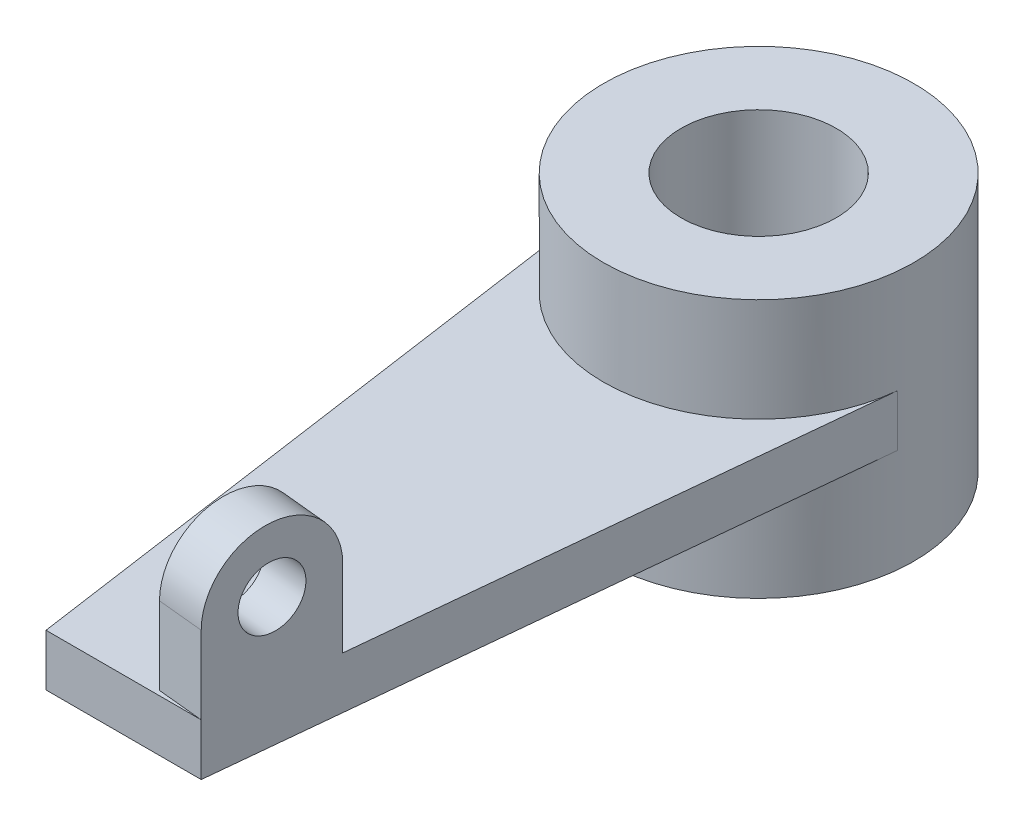
ISO-10303-21;
HEADER;
FILE_DESCRIPTION(('STEP AP214'),'2;1');
FILE_NAME('part.step','',(''),(''),'','','');
FILE_SCHEMA(('AUTOMOTIVE_DESIGN { 1 0 10303 214 1 1 1 1 }'));
ENDSEC;
DATA;
#1=APPLICATION_CONTEXT('core data for automotive mechanical design processes');
#2=APPLICATION_PROTOCOL_DEFINITION('international standard','automotive_design',2000,#1);
#3=PRODUCT_CONTEXT('',#1,'mechanical');
#4=PRODUCT('Part','Part','',(#3));
#5=PRODUCT_RELATED_PRODUCT_CATEGORY('part','',(#4));
#6=PRODUCT_DEFINITION_FORMATION('','',#4);
#7=PRODUCT_DEFINITION_CONTEXT('part definition',#1,'design');
#8=PRODUCT_DEFINITION('design','',#6,#7);
#9=PRODUCT_DEFINITION_SHAPE('','',#8);
#10=(LENGTH_UNIT() NAMED_UNIT(*) SI_UNIT(.MILLI.,.METRE.));
#11=(NAMED_UNIT(*) PLANE_ANGLE_UNIT() SI_UNIT($,.RADIAN.));
#12=(NAMED_UNIT(*) SI_UNIT($,.STERADIAN.) SOLID_ANGLE_UNIT());
#13=UNCERTAINTY_MEASURE_WITH_UNIT(LENGTH_MEASURE(1.E-05),#10,'distance_accuracy_value','');
#14=(GEOMETRIC_REPRESENTATION_CONTEXT(3) GLOBAL_UNCERTAINTY_ASSIGNED_CONTEXT((#13)) GLOBAL_UNIT_ASSIGNED_CONTEXT((#10,
#11,#12)) REPRESENTATION_CONTEXT('',''));
#15=CARTESIAN_POINT('',(0.,0.,0.));
#16=DIRECTION('',(0.,0.,1.));
#17=DIRECTION('',(1.,0.,0.));
#18=AXIS2_PLACEMENT_3D('',#15,#16,#17);
#19=CARTESIAN_POINT('',(0.,25.,0.));
#20=DIRECTION('',(0.,1.,0.));
#21=DIRECTION('',(0.,0.,1.));
#22=AXIS2_PLACEMENT_3D('',#19,#20,#21);
#23=PLANE('',#22);
#24=CARTESIAN_POINT('',(0.,25.,0.));
#25=DIRECTION('',(0.,1.,0.));
#26=DIRECTION('',(0.,0.,1.));
#27=AXIS2_PLACEMENT_3D('',#24,#25,#26);
#28=CIRCLE('',#27,30.);
#29=CARTESIAN_POINT('',(0.,25.,30.));
#30=VERTEX_POINT('',#29);
#31=EDGE_CURVE('E175',#30,#30,#28,.T.);
#32=ORIENTED_EDGE('',*,*,#31,.T.);
#33=EDGE_LOOP('',(#32));
#34=FACE_BOUND('',#33,.T.);
#35=CARTESIAN_POINT('',(0.,25.,0.));
#36=DIRECTION('',(0.,1.,0.));
#37=DIRECTION('',(0.,0.,1.));
#38=AXIS2_PLACEMENT_3D('',#35,#36,#37);
#39=CIRCLE('',#38,15.);
#40=CARTESIAN_POINT('',(0.,25.,15.));
#41=VERTEX_POINT('',#40);
#42=EDGE_CURVE('E169',#41,#41,#39,.T.);
#43=ORIENTED_EDGE('',*,*,#42,.F.);
#44=EDGE_LOOP('',(#43));
#45=FACE_BOUND('',#44,.T.);
#46=ADVANCED_FACE('F33',(#34,#45),#23,.T.);
#47=CARTESIAN_POINT('',(0.,-25.,0.));
#48=DIRECTION('',(0.,1.,0.));
#49=DIRECTION('',(0.,0.,1.));
#50=AXIS2_PLACEMENT_3D('',#47,#48,#49);
#51=PLANE('',#50);
#52=CARTESIAN_POINT('',(0.,-25.,0.));
#53=DIRECTION('',(0.,1.,0.));
#54=DIRECTION('',(0.,0.,1.));
#55=AXIS2_PLACEMENT_3D('',#52,#53,#54);
#56=CIRCLE('',#55,30.);
#57=CARTESIAN_POINT('',(0.,-25.,30.));
#58=VERTEX_POINT('',#57);
#59=EDGE_CURVE('E172',#58,#58,#56,.T.);
#60=ORIENTED_EDGE('',*,*,#59,.F.);
#61=EDGE_LOOP('',(#60));
#62=FACE_BOUND('',#61,.T.);
#63=CARTESIAN_POINT('',(0.,-25.,0.));
#64=DIRECTION('',(0.,1.,0.));
#65=DIRECTION('',(0.,0.,1.));
#66=AXIS2_PLACEMENT_3D('',#63,#64,#65);
#67=CIRCLE('',#66,15.);
#68=CARTESIAN_POINT('',(0.,-25.,15.));
#69=VERTEX_POINT('',#68);
#70=EDGE_CURVE('E166',#69,#69,#67,.T.);
#71=ORIENTED_EDGE('',*,*,#70,.T.);
#72=EDGE_LOOP('',(#71));
#73=FACE_BOUND('',#72,.T.);
#74=ADVANCED_FACE('F213',(#62,#73),#51,.F.);
#75=CARTESIAN_POINT('',(0.,25.,0.));
#76=DIRECTION('',(0.,-1.,0.));
#77=DIRECTION('',(0.,0.,-1.));
#78=AXIS2_PLACEMENT_3D('',#75,#76,#77);
#79=CYLINDRICAL_SURFACE('',#78,30.);
#80=DIRECTION('',(0.,-1.,0.));
#81=VECTOR('',#80,1.);
#82=CARTESIAN_POINT('',(-29.4767542956584,25.,5.5786159747186));
#83=LINE('',#82,#81);
#84=CARTESIAN_POINT('',(-29.4767542956584,5.,5.5786159747186));
#85=VERTEX_POINT('',#84);
#86=CARTESIAN_POINT('',(-29.4767542956584,-5.,5.57861597471867));
#87=VERTEX_POINT('',#86);
#88=EDGE_CURVE('E11',#85,#87,#83,.T.);
#89=ORIENTED_EDGE('',*,*,#88,.F.);
#90=CARTESIAN_POINT('',(0.,5.,0.));
#91=DIRECTION('',(0.,1.,0.));
#92=DIRECTION('',(0.,0.,1.));
#93=AXIS2_PLACEMENT_3D('',#90,#91,#92);
#94=CIRCLE('',#93,30.);
#95=CARTESIAN_POINT('',(29.845255902854,5.,3.04313984120936));
#96=VERTEX_POINT('',#95);
#97=EDGE_CURVE('E159',#85,#96,#94,.T.);
#98=ORIENTED_EDGE('',*,*,#97,.T.);
#99=DIRECTION('',(0.,-1.,0.));
#100=VECTOR('',#99,1.);
#101=CARTESIAN_POINT('',(29.845255902854,25.,3.04313984120936));
#102=LINE('',#101,#100);
#103=CARTESIAN_POINT('',(29.8452559028544,-5.,3.04313984120625));
#104=VERTEX_POINT('',#103);
#105=EDGE_CURVE('E43',#104,#96,#102,.F.);
#106=ORIENTED_EDGE('',*,*,#105,.F.);
#107=CARTESIAN_POINT('',(0.,-5.,0.));
#108=DIRECTION('',(0.,1.,0.));
#109=DIRECTION('',(0.,0.,1.));
#110=AXIS2_PLACEMENT_3D('',#107,#108,#109);
#111=CIRCLE('',#110,30.);
#112=EDGE_CURVE('E151',#87,#104,#111,.T.);
#113=ORIENTED_EDGE('',*,*,#112,.F.);
#114=EDGE_LOOP('',(#89,#98,#106,#113));
#115=FACE_BOUND('',#114,.T.);
#116=ORIENTED_EDGE('',*,*,#31,.F.);
#117=EDGE_LOOP('',(#116));
#118=FACE_BOUND('',#117,.T.);
#119=ORIENTED_EDGE('',*,*,#59,.T.);
#120=EDGE_LOOP('',(#119));
#121=FACE_BOUND('',#120,.T.);
#122=ADVANCED_FACE('F35',(#115,#118,#121),#79,.T.);
#123=CARTESIAN_POINT('',(0.,25.,0.));
#124=DIRECTION('',(0.,-1.,0.));
#125=DIRECTION('',(0.,0.,-1.));
#126=AXIS2_PLACEMENT_3D('',#123,#124,#125);
#127=CYLINDRICAL_SURFACE('',#126,15.);
#128=ORIENTED_EDGE('',*,*,#70,.F.);
#129=EDGE_LOOP('',(#128));
#130=FACE_BOUND('',#129,.T.);
#131=ORIENTED_EDGE('',*,*,#42,.T.);
#132=EDGE_LOOP('',(#131));
#133=FACE_BOUND('',#132,.T.);
#134=ADVANCED_FACE('F222',(#130,#133),#127,.F.);
#135=CARTESIAN_POINT('',(-12.3448321492446,5.,125.404806205229));
#136=DIRECTION('',(0.989933416380212,0.,-0.141533851547263));
#137=DIRECTION('',(-0.141533851547263,0.,-0.989933416380212));
#138=AXIS2_PLACEMENT_3D('',#135,#136,#137);
#139=PLANE('',#138);
#140=DIRECTION('',(0.141533851547263,0.,0.989933416380212));
#141=VECTOR('',#140,1.);
#142=CARTESIAN_POINT('',(-12.3448321492446,5.,125.404806205229));
#143=LINE('',#142,#141);
#144=CARTESIAN_POINT('',(-12.3448321492446,5.,125.404806205229));
#145=VERTEX_POINT('',#144);
#146=EDGE_CURVE('E137',#85,#145,#143,.T.);
#147=ORIENTED_EDGE('',*,*,#146,.F.);
#148=ORIENTED_EDGE('',*,*,#88,.T.);
#149=DIRECTION('',(0.141533851547263,0.,0.989933416380212));
#150=VECTOR('',#149,1.);
#151=CARTESIAN_POINT('',(-12.3448321492446,-5.,125.404806205229));
#152=LINE('',#151,#150);
#153=CARTESIAN_POINT('',(-12.3448321492446,-5.,125.404806205229));
#154=VERTEX_POINT('',#153);
#155=EDGE_CURVE('E133',#87,#154,#152,.T.);
#156=ORIENTED_EDGE('',*,*,#155,.T.);
#157=DIRECTION('',(0.,-1.,0.));
#158=VECTOR('',#157,1.);
#159=CARTESIAN_POINT('',(-12.3448321492446,5.,125.404806205229));
#160=LINE('',#159,#158);
#161=EDGE_CURVE('E148',#145,#154,#160,.T.);
#162=ORIENTED_EDGE('',*,*,#161,.F.);
#163=EDGE_LOOP('',(#147,#148,#156,#162));
#164=FACE_BOUND('',#163,.T.);
#165=ADVANCED_FACE('F194',(#164),#139,.F.);
#166=CARTESIAN_POINT('',(29.859037173192,5.,2.90480620522945));
#167=DIRECTION('',(-0.995074222232423,0.,-0.099132700197957));
#168=DIRECTION('',(-0.099132700197957,0.,0.995074222232423));
#169=AXIS2_PLACEMENT_3D('',#166,#167,#168);
#170=PLANE('',#169);
#171=DIRECTION('',(0.099132700197957,0.,-0.995074222232423));
#172=VECTOR('',#171,1.);
#173=CARTESIAN_POINT('',(29.859037173192,-5.,2.90480620522945));
#174=LINE('',#173,#172);
#175=CARTESIAN_POINT('',(17.6551678507554,-5.,125.404806205229));
#176=VERTEX_POINT('',#175);
#177=EDGE_CURVE('E140',#176,#104,#174,.T.);
#178=ORIENTED_EDGE('',*,*,#177,.T.);
#179=ORIENTED_EDGE('',*,*,#105,.T.);
#180=DIRECTION('',(0.099132700197957,0.,-0.995074222232423));
#181=VECTOR('',#180,1.);
#182=CARTESIAN_POINT('',(29.859037173192,5.,2.90480620522945));
#183=LINE('',#182,#181);
#184=CARTESIAN_POINT('',(20.1334853557043,5.,100.527950649419));
#185=VERTEX_POINT('',#184);
#186=EDGE_CURVE('E37',#185,#96,#183,.T.);
#187=ORIENTED_EDGE('',*,*,#186,.F.);
#188=DIRECTION('',(0.,1.,0.));
#189=VECTOR('',#188,1.);
#190=CARTESIAN_POINT('',(20.1334853557043,20.,100.527950649419));
#191=LINE('',#190,#189);
#192=CARTESIAN_POINT('',(20.1334853557043,20.,100.527950649419));
#193=VERTEX_POINT('',#192);
#194=EDGE_CURVE('E118',#185,#193,#191,.T.);
#195=ORIENTED_EDGE('',*,*,#194,.T.);
#196=CARTESIAN_POINT('',(18.8943266032298,20.,112.966378427324));
#197=DIRECTION('',(0.995074222232423,0.,0.0991327001979571));
#198=DIRECTION('',(0.0991327001979571,0.,-0.995074222232423));
#199=AXIS2_PLACEMENT_3D('',#196,#197,#198);
#200=CIRCLE('',#199,12.5);
#201=CARTESIAN_POINT('',(17.6551678507554,20.,125.404806205229));
#202=VERTEX_POINT('',#201);
#203=EDGE_CURVE('E128',#193,#202,#200,.T.);
#204=ORIENTED_EDGE('',*,*,#203,.T.);
#205=DIRECTION('',(0.,-1.,0.));
#206=VECTOR('',#205,1.);
#207=CARTESIAN_POINT('',(17.6551678507554,20.,125.404806205229));
#208=LINE('',#207,#206);
#209=CARTESIAN_POINT('',(17.6551678507554,5.,125.404806205229));
#210=VERTEX_POINT('',#209);
#211=EDGE_CURVE('E102',#202,#210,#208,.T.);
#212=ORIENTED_EDGE('',*,*,#211,.T.);
#213=DIRECTION('',(0.,-1.,0.));
#214=VECTOR('',#213,1.);
#215=CARTESIAN_POINT('',(17.6551678507554,5.,125.404806205229));
#216=LINE('',#215,#214);
#217=EDGE_CURVE('E145',#210,#176,#216,.T.);
#218=ORIENTED_EDGE('',*,*,#217,.T.);
#219=EDGE_LOOP('',(#178,#179,#187,#195,#204,#212,#218));
#220=FACE_BOUND('',#219,.T.);
#221=CARTESIAN_POINT('',(18.8943266032298,20.,112.966378427324));
#222=DIRECTION('',(0.995074222232423,0.,0.0991327001979571));
#223=DIRECTION('',(0.0991327001979571,0.,-0.995074222232423));
#224=AXIS2_PLACEMENT_3D('',#221,#222,#223);
#225=CIRCLE('',#224,6.00000000000001);
#226=CARTESIAN_POINT('',(19.4891228044176,20.,106.99593309393));
#227=VERTEX_POINT('',#226);
#228=EDGE_CURVE('E123',#227,#227,#225,.T.);
#229=ORIENTED_EDGE('',*,*,#228,.F.);
#230=EDGE_LOOP('',(#229));
#231=FACE_BOUND('',#230,.T.);
#232=ADVANCED_FACE('F181',(#220,#231),#170,.F.);
#233=CARTESIAN_POINT('',(17.6551678507554,5.,125.404806205229));
#234=DIRECTION('',(0.,0.,-1.));
#235=DIRECTION('',(-1.,0.,0.));
#236=AXIS2_PLACEMENT_3D('',#233,#234,#235);
#237=PLANE('',#236);
#238=DIRECTION('',(1.,0.,0.));
#239=VECTOR('',#238,1.);
#240=CARTESIAN_POINT('',(17.6551678507554,-5.,125.404806205229));
#241=LINE('',#240,#239);
#242=EDGE_CURVE('E143',#154,#176,#241,.T.);
#243=ORIENTED_EDGE('',*,*,#242,.T.);
#244=ORIENTED_EDGE('',*,*,#217,.F.);
#245=DIRECTION('',(1.,0.,0.));
#246=VECTOR('',#245,1.);
#247=CARTESIAN_POINT('',(17.6551678507554,5.,125.404806205229));
#248=LINE('',#247,#246);
#249=EDGE_CURVE('E139',#145,#210,#248,.T.);
#250=ORIENTED_EDGE('',*,*,#249,.F.);
#251=ORIENTED_EDGE('',*,*,#161,.T.);
#252=EDGE_LOOP('',(#243,#244,#250,#251));
#253=FACE_BOUND('',#252,.T.);
#254=ADVANCED_FACE('F197',(#253),#237,.F.);
#255=CARTESIAN_POINT('',(0.,5.,0.));
#256=DIRECTION('',(0.,1.,0.));
#257=DIRECTION('',(0.,0.,1.));
#258=AXIS2_PLACEMENT_3D('',#255,#256,#257);
#259=PLANE('',#258);
#260=DIRECTION('',(0.995074222232423,0.,0.099132700197957));
#261=VECTOR('',#260,1.);
#262=CARTESIAN_POINT('',(11.1778173556125,5.,99.6357563476372));
#263=LINE('',#262,#261);
#264=CARTESIAN_POINT('',(11.1778173556125,5.,99.6357563476372));
#265=VERTEX_POINT('',#264);
#266=EDGE_CURVE('E134',#265,#185,#263,.T.);
#267=ORIENTED_EDGE('',*,*,#266,.T.);
#268=ORIENTED_EDGE('',*,*,#186,.T.);
#269=ORIENTED_EDGE('',*,*,#97,.F.);
#270=ORIENTED_EDGE('',*,*,#146,.T.);
#271=ORIENTED_EDGE('',*,*,#249,.T.);
#272=DIRECTION('',(0.995074222232423,0.,0.099132700197957));
#273=VECTOR('',#272,1.);
#274=CARTESIAN_POINT('',(8.69949985066354,5.,124.512611903448));
#275=LINE('',#274,#273);
#276=CARTESIAN_POINT('',(8.69949985066354,5.,124.512611903448));
#277=VERTEX_POINT('',#276);
#278=EDGE_CURVE('E56',#277,#210,#275,.T.);
#279=ORIENTED_EDGE('',*,*,#278,.F.);
#280=DIRECTION('',(0.099132700197957,0.,-0.995074222232423));
#281=VECTOR('',#280,1.);
#282=CARTESIAN_POINT('',(11.1778173556125,5.,99.6357563476372));
#283=LINE('',#282,#281);
#284=EDGE_CURVE('E51',#277,#265,#283,.T.);
#285=ORIENTED_EDGE('',*,*,#284,.T.);
#286=EDGE_LOOP('',(#267,#268,#269,#270,#271,#279,#285));
#287=FACE_BOUND('',#286,.T.);
#288=ADVANCED_FACE('F199',(#287),#259,.T.);
#289=CARTESIAN_POINT('',(0.,-5.,0.));
#290=DIRECTION('',(0.,1.,0.));
#291=DIRECTION('',(0.,0.,1.));
#292=AXIS2_PLACEMENT_3D('',#289,#290,#291);
#293=PLANE('',#292);
#294=ORIENTED_EDGE('',*,*,#155,.F.);
#295=ORIENTED_EDGE('',*,*,#112,.T.);
#296=ORIENTED_EDGE('',*,*,#177,.F.);
#297=ORIENTED_EDGE('',*,*,#242,.F.);
#298=EDGE_LOOP('',(#294,#295,#296,#297));
#299=FACE_BOUND('',#298,.T.);
#300=ADVANCED_FACE('F189',(#299),#293,.F.);
#301=CARTESIAN_POINT('',(9.938658603138,20.,112.074184125543));
#302=DIRECTION('',(0.995074222232423,0.,0.099132700197957));
#303=DIRECTION('',(0.0991327001979571,0.,-0.995074222232423));
#304=AXIS2_PLACEMENT_3D('',#301,#302,#303);
#305=CYLINDRICAL_SURFACE('',#304,12.5);
#306=ORIENTED_EDGE('',*,*,#203,.F.);
#307=DIRECTION('',(0.995074222232423,0.,0.099132700197957));
#308=VECTOR('',#307,1.);
#309=CARTESIAN_POINT('',(11.1778173556125,20.,99.6357563476372));
#310=LINE('',#309,#308);
#311=CARTESIAN_POINT('',(11.1778173556125,20.,99.6357563476372));
#312=VERTEX_POINT('',#311);
#313=EDGE_CURVE('E117',#312,#193,#310,.T.);
#314=ORIENTED_EDGE('',*,*,#313,.F.);
#315=CARTESIAN_POINT('',(9.938658603138,20.,112.074184125543));
#316=DIRECTION('',(0.995074222232423,0.,0.0991327001979571));
#317=DIRECTION('',(0.0991327001979571,0.,-0.995074222232423));
#318=AXIS2_PLACEMENT_3D('',#315,#316,#317);
#319=CIRCLE('',#318,12.5);
#320=CARTESIAN_POINT('',(8.69949985066354,20.,124.512611903448));
#321=VERTEX_POINT('',#320);
#322=EDGE_CURVE('E113',#312,#321,#319,.T.);
#323=ORIENTED_EDGE('',*,*,#322,.T.);
#324=DIRECTION('',(0.995074222232423,0.,0.099132700197957));
#325=VECTOR('',#324,1.);
#326=CARTESIAN_POINT('',(8.69949985066354,20.,124.512611903448));
#327=LINE('',#326,#325);
#328=EDGE_CURVE('E97',#321,#202,#327,.T.);
#329=ORIENTED_EDGE('',*,*,#328,.T.);
#330=EDGE_LOOP('',(#306,#314,#323,#329));
#331=FACE_BOUND('',#330,.T.);
#332=ADVANCED_FACE('F116',(#331),#305,.T.);
#333=CARTESIAN_POINT('',(11.1778173556125,20.,99.6357563476372));
#334=DIRECTION('',(0.0991327001979571,0.,-0.995074222232423));
#335=DIRECTION('',(-0.995074222232423,0.,-0.0991327001979571));
#336=AXIS2_PLACEMENT_3D('',#333,#334,#335);
#337=PLANE('',#336);
#338=ORIENTED_EDGE('',*,*,#194,.F.);
#339=ORIENTED_EDGE('',*,*,#266,.F.);
#340=DIRECTION('',(0.,1.,0.));
#341=VECTOR('',#340,1.);
#342=CARTESIAN_POINT('',(11.1778173556125,20.,99.6357563476372));
#343=LINE('',#342,#341);
#344=EDGE_CURVE('E107',#265,#312,#343,.T.);
#345=ORIENTED_EDGE('',*,*,#344,.T.);
#346=ORIENTED_EDGE('',*,*,#313,.T.);
#347=EDGE_LOOP('',(#338,#339,#345,#346));
#348=FACE_BOUND('',#347,.T.);
#349=ADVANCED_FACE('F202',(#348),#337,.T.);
#350=CARTESIAN_POINT('',(8.69949985066354,20.,124.512611903448));
#351=DIRECTION('',(-0.099132700197957,0.,0.995074222232423));
#352=DIRECTION('',(0.995074222232423,0.,0.0991327001979571));
#353=AXIS2_PLACEMENT_3D('',#350,#351,#352);
#354=PLANE('',#353);
#355=ORIENTED_EDGE('',*,*,#211,.F.);
#356=ORIENTED_EDGE('',*,*,#328,.F.);
#357=DIRECTION('',(0.,-1.,0.));
#358=VECTOR('',#357,1.);
#359=CARTESIAN_POINT('',(8.69949985066354,20.,124.512611903448));
#360=LINE('',#359,#358);
#361=EDGE_CURVE('E100',#321,#277,#360,.T.);
#362=ORIENTED_EDGE('',*,*,#361,.T.);
#363=ORIENTED_EDGE('',*,*,#278,.T.);
#364=EDGE_LOOP('',(#355,#356,#362,#363));
#365=FACE_BOUND('',#364,.T.);
#366=ADVANCED_FACE('F99',(#365),#354,.T.);
#367=CARTESIAN_POINT('',(9.938658603138,20.,112.074184125543));
#368=DIRECTION('',(0.995074222232423,0.,0.0991327001979571));
#369=DIRECTION('',(0.0991327001979571,0.,-0.995074222232423));
#370=AXIS2_PLACEMENT_3D('',#367,#368,#369);
#371=PLANE('',#370);
#372=CARTESIAN_POINT('',(9.938658603138,20.,112.074184125543));
#373=DIRECTION('',(0.995074222232423,0.,0.0991327001979571));
#374=DIRECTION('',(0.0991327001979571,0.,-0.995074222232423));
#375=AXIS2_PLACEMENT_3D('',#372,#373,#374);
#376=CIRCLE('',#375,6.00000000000001);
#377=CARTESIAN_POINT('',(10.5334548043257,20.,106.103738792148));
#378=VERTEX_POINT('',#377);
#379=EDGE_CURVE('E130',#378,#378,#376,.T.);
#380=ORIENTED_EDGE('',*,*,#379,.T.);
#381=EDGE_LOOP('',(#380));
#382=FACE_BOUND('',#381,.T.);
#383=ORIENTED_EDGE('',*,*,#322,.F.);
#384=ORIENTED_EDGE('',*,*,#344,.F.);
#385=ORIENTED_EDGE('',*,*,#284,.F.);
#386=ORIENTED_EDGE('',*,*,#361,.F.);
#387=EDGE_LOOP('',(#383,#384,#385,#386));
#388=FACE_BOUND('',#387,.T.);
#389=ADVANCED_FACE('F111',(#382,#388),#371,.F.);
#390=CARTESIAN_POINT('',(9.938658603138,20.,112.074184125543));
#391=DIRECTION('',(0.995074222232423,0.,0.099132700197957));
#392=DIRECTION('',(0.0991327001979571,0.,-0.995074222232423));
#393=AXIS2_PLACEMENT_3D('',#390,#391,#392);
#394=CYLINDRICAL_SURFACE('',#393,6.00000000000001);
#395=ORIENTED_EDGE('',*,*,#379,.F.);
#396=EDGE_LOOP('',(#395));
#397=FACE_BOUND('',#396,.T.);
#398=ORIENTED_EDGE('',*,*,#228,.T.);
#399=EDGE_LOOP('',(#398));
#400=FACE_BOUND('',#399,.T.);
#401=ADVANCED_FACE('F269',(#397,#400),#394,.F.);
#402=CLOSED_SHELL('',(#46,#74,#122,#134,#165,#232,#254,#288,#300,#332,#349,#366,#389,#401));
#403=MANIFOLD_SOLID_BREP('B2',#402);
#404=ADVANCED_BREP_SHAPE_REPRESENTATION('',(#18,#403),#14);
#405=SHAPE_DEFINITION_REPRESENTATION(#9,#404);
ENDSEC;
END-ISO-10303-21;
